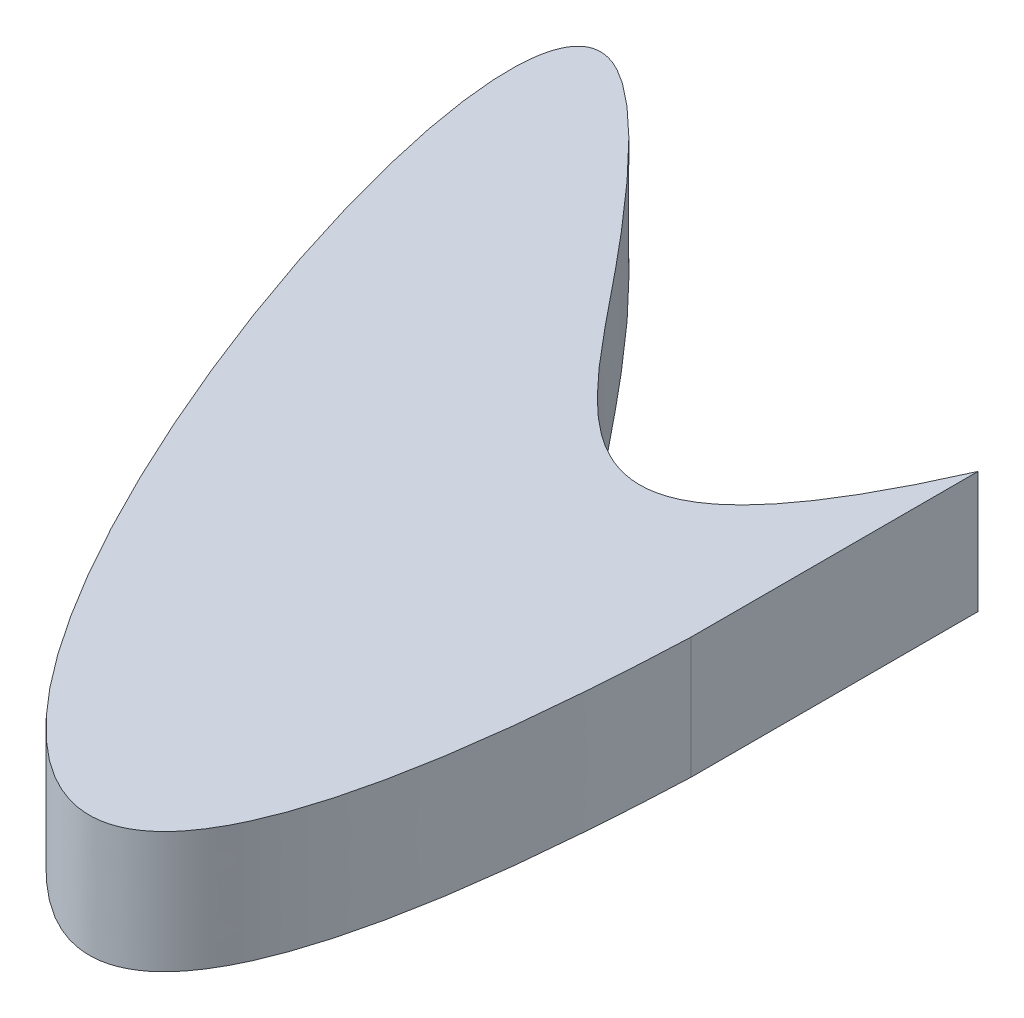
ISO-10303-21;
HEADER;
FILE_DESCRIPTION(('STEP AP214'),'2;1');
FILE_NAME('part.step','',(''),(''),'','','');
FILE_SCHEMA(('AUTOMOTIVE_DESIGN { 1 0 10303 214 1 1 1 1 }'));
ENDSEC;
DATA;
#1=APPLICATION_CONTEXT('core data for automotive mechanical design processes');
#2=APPLICATION_PROTOCOL_DEFINITION('international standard','automotive_design',2000,#1);
#3=PRODUCT_CONTEXT('',#1,'mechanical');
#4=PRODUCT('Part','Part','',(#3));
#5=PRODUCT_RELATED_PRODUCT_CATEGORY('part','',(#4));
#6=PRODUCT_DEFINITION_FORMATION('','',#4);
#7=PRODUCT_DEFINITION_CONTEXT('part definition',#1,'design');
#8=PRODUCT_DEFINITION('design','',#6,#7);
#9=PRODUCT_DEFINITION_SHAPE('','',#8);
#10=(LENGTH_UNIT() NAMED_UNIT(*) SI_UNIT(.MILLI.,.METRE.));
#11=(NAMED_UNIT(*) PLANE_ANGLE_UNIT() SI_UNIT($,.RADIAN.));
#12=(NAMED_UNIT(*) SI_UNIT($,.STERADIAN.) SOLID_ANGLE_UNIT());
#13=UNCERTAINTY_MEASURE_WITH_UNIT(LENGTH_MEASURE(1.E-05),#10,'distance_accuracy_value','');
#14=(GEOMETRIC_REPRESENTATION_CONTEXT(3) GLOBAL_UNCERTAINTY_ASSIGNED_CONTEXT((#13)) GLOBAL_UNIT_ASSIGNED_CONTEXT((#10,
#11,#12)) REPRESENTATION_CONTEXT('',''));
#15=CARTESIAN_POINT('',(0.,0.,0.));
#16=DIRECTION('',(0.,0.,1.));
#17=DIRECTION('',(1.,0.,0.));
#18=AXIS2_PLACEMENT_3D('',#15,#16,#17);
#19=CARTESIAN_POINT('',(0.,6.35,-4.18579954012555));
#20=CARTESIAN_POINT('',(-7.06112727333322,6.35,11.8770600881594));
#21=CARTESIAN_POINT('',(-14.5137546900942,6.35,0.363021622792856));
#22=CARTESIAN_POINT('',(-47.0690696384379,6.35,-35.8620577487262));
#23=CARTESIAN_POINT('',(-2.66085097292552,6.35,77.8297378331622));
#24=CARTESIAN_POINT('',(0.,6.35,10.8142004598744));
#25=B_SPLINE_CURVE_WITH_KNOTS('',3,(#19,#20,#21,#22,#23,#24),.UNSPECIFIED.,.F.,.F.,(4,1,1,4),
(0.,0.226806389285483,0.34503021232198,1.),.UNSPECIFIED.);
#26=DIRECTION('',(0.,-1.,0.));
#27=VECTOR('',#26,1.);
#28=SURFACE_OF_LINEAR_EXTRUSION('',#25,#27);
#29=CARTESIAN_POINT('',(0.,0.,-4.18579954012555));
#30=CARTESIAN_POINT('',(-7.06112727333322,0.,11.8770600881594));
#31=CARTESIAN_POINT('',(-14.5137546900942,0.,0.363021622792856));
#32=CARTESIAN_POINT('',(-47.0690696384379,0.,-35.8620577487262));
#33=CARTESIAN_POINT('',(-2.66085097292552,0.,77.8297378331622));
#34=CARTESIAN_POINT('',(0.,0.,10.8142004598744));
#35=B_SPLINE_CURVE_WITH_KNOTS('',3,(#29,#30,#31,#32,#33,#34),.UNSPECIFIED.,.F.,.F.,(4,1,1,4),
(0.,0.226806389285483,0.34503021232198,1.),.UNSPECIFIED.);
#36=CARTESIAN_POINT('',(0.,0.,-4.18579954012555));
#37=VERTEX_POINT('',#36);
#38=CARTESIAN_POINT('',(0.,0.,10.8142004598744));
#39=VERTEX_POINT('',#38);
#40=EDGE_CURVE('E77',#37,#39,#35,.T.);
#41=ORIENTED_EDGE('',*,*,#40,.T.);
#42=DIRECTION('',(0.,-1.,0.));
#43=VECTOR('',#42,1.);
#44=CARTESIAN_POINT('',(0.,6.35,10.8142004598744));
#45=LINE('',#44,#43);
#46=CARTESIAN_POINT('',(0.,6.35,10.8142004598744));
#47=VERTEX_POINT('',#46);
#48=EDGE_CURVE('E11',#47,#39,#45,.T.);
#49=ORIENTED_EDGE('',*,*,#48,.F.);
#50=CARTESIAN_POINT('',(0.,6.35,-4.18579954012555));
#51=VERTEX_POINT('',#50);
#52=EDGE_CURVE('E76',#51,#47,#25,.T.);
#53=ORIENTED_EDGE('',*,*,#52,.F.);
#54=DIRECTION('',(0.,-1.,0.));
#55=VECTOR('',#54,1.);
#56=CARTESIAN_POINT('',(0.,6.35,-4.18579954012555));
#57=LINE('',#56,#55);
#58=EDGE_CURVE('E53',#51,#37,#57,.T.);
#59=ORIENTED_EDGE('',*,*,#58,.T.);
#60=EDGE_LOOP('',(#41,#49,#53,#59));
#61=FACE_BOUND('',#60,.T.);
#62=ADVANCED_FACE('F43',(#61),#28,.F.);
#63=CARTESIAN_POINT('',(0.,6.35,-4.18579954012555));
#64=DIRECTION('',(-1.,0.,0.));
#65=DIRECTION('',(0.,0.,1.));
#66=AXIS2_PLACEMENT_3D('',#63,#64,#65);
#67=PLANE('',#66);
#68=DIRECTION('',(0.,0.,-1.));
#69=VECTOR('',#68,1.);
#70=CARTESIAN_POINT('',(0.,0.,-4.18579954012555));
#71=LINE('',#70,#69);
#72=EDGE_CURVE('E68',#39,#37,#71,.T.);
#73=ORIENTED_EDGE('',*,*,#72,.T.);
#74=ORIENTED_EDGE('',*,*,#58,.F.);
#75=DIRECTION('',(0.,0.,-1.));
#76=VECTOR('',#75,1.);
#77=CARTESIAN_POINT('',(0.,6.35,-4.18579954012555));
#78=LINE('',#77,#76);
#79=EDGE_CURVE('E60',#47,#51,#78,.T.);
#80=ORIENTED_EDGE('',*,*,#79,.F.);
#81=ORIENTED_EDGE('',*,*,#48,.T.);
#82=EDGE_LOOP('',(#73,#74,#80,#81));
#83=FACE_BOUND('',#82,.T.);
#84=ADVANCED_FACE('F71',(#83),#67,.F.);
#85=CARTESIAN_POINT('',(-29.445635818881,6.35,-3.35235433487157));
#86=DIRECTION('',(0.,1.,0.));
#87=DIRECTION('',(0.,0.,1.));
#88=AXIS2_PLACEMENT_3D('',#85,#86,#87);
#89=PLANE('',#88);
#90=ORIENTED_EDGE('',*,*,#52,.T.);
#91=ORIENTED_EDGE('',*,*,#79,.T.);
#92=EDGE_LOOP('',(#90,#91));
#93=FACE_BOUND('',#92,.T.);
#94=ADVANCED_FACE('F98',(#93),#89,.T.);
#95=CARTESIAN_POINT('',(-29.445635818881,0.,-3.35235433487157));
#96=DIRECTION('',(0.,1.,0.));
#97=DIRECTION('',(0.,0.,1.));
#98=AXIS2_PLACEMENT_3D('',#95,#96,#97);
#99=PLANE('',#98);
#100=ORIENTED_EDGE('',*,*,#40,.F.);
#101=ORIENTED_EDGE('',*,*,#72,.F.);
#102=EDGE_LOOP('',(#100,#101));
#103=FACE_BOUND('',#102,.T.);
#104=ADVANCED_FACE('F81',(#103),#99,.F.);
#105=CLOSED_SHELL('',(#62,#84,#94,#104));
#106=MANIFOLD_SOLID_BREP('B2',#105);
#107=ADVANCED_BREP_SHAPE_REPRESENTATION('',(#18,#106),#14);
#108=SHAPE_DEFINITION_REPRESENTATION(#9,#107);
ENDSEC;
END-ISO-10303-21;
